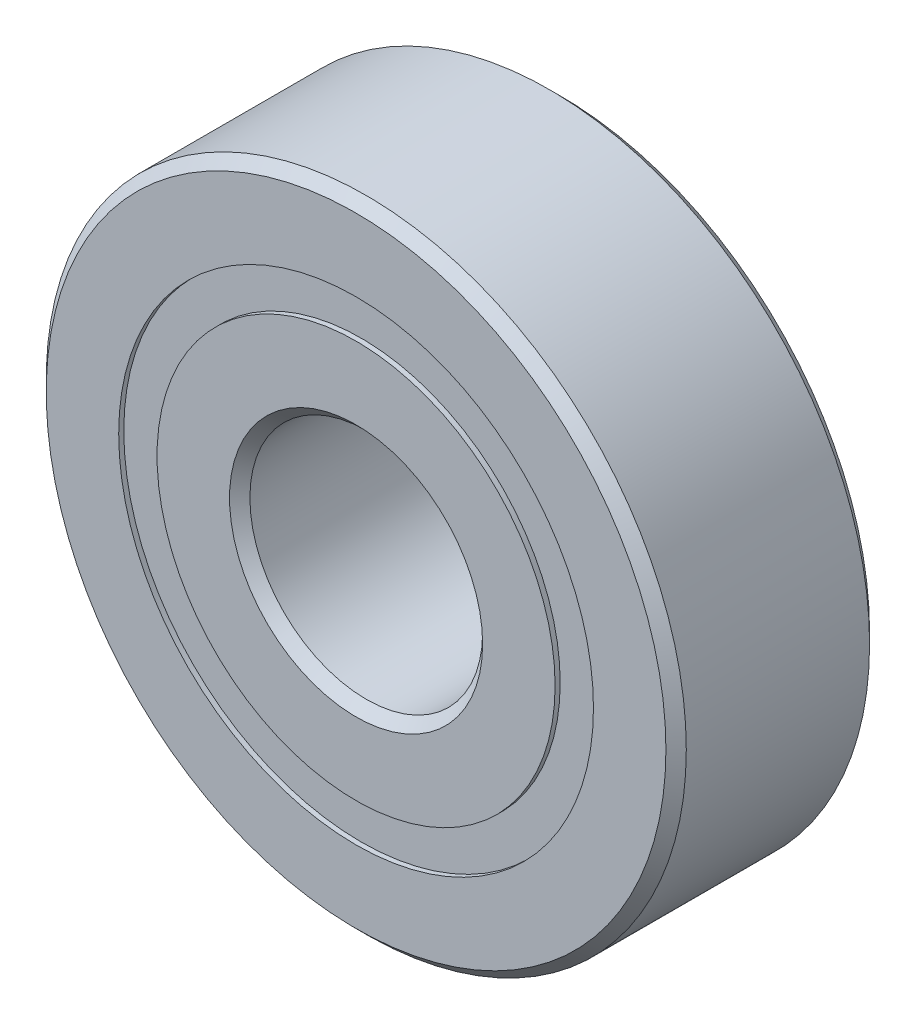
ISO-10303-21;
HEADER;
FILE_DESCRIPTION(('STEP AP214'),'2;1');
FILE_NAME('part.step','',(''),(''),'','','');
FILE_SCHEMA(('AUTOMOTIVE_DESIGN { 1 0 10303 214 1 1 1 1 }'));
ENDSEC;
DATA;
#1=APPLICATION_CONTEXT('core data for automotive mechanical design processes');
#2=APPLICATION_PROTOCOL_DEFINITION('international standard','automotive_design',2000,#1);
#3=PRODUCT_CONTEXT('',#1,'mechanical');
#4=PRODUCT('Part','Part','',(#3));
#5=PRODUCT_RELATED_PRODUCT_CATEGORY('part','',(#4));
#6=PRODUCT_DEFINITION_FORMATION('','',#4);
#7=PRODUCT_DEFINITION_CONTEXT('part definition',#1,'design');
#8=PRODUCT_DEFINITION('design','',#6,#7);
#9=PRODUCT_DEFINITION_SHAPE('','',#8);
#10=(LENGTH_UNIT() NAMED_UNIT(*) SI_UNIT(.MILLI.,.METRE.));
#11=(NAMED_UNIT(*) PLANE_ANGLE_UNIT() SI_UNIT($,.RADIAN.));
#12=(NAMED_UNIT(*) SI_UNIT($,.STERADIAN.) SOLID_ANGLE_UNIT());
#13=UNCERTAINTY_MEASURE_WITH_UNIT(LENGTH_MEASURE(1.E-05),#10,'distance_accuracy_value','');
#14=(GEOMETRIC_REPRESENTATION_CONTEXT(3) GLOBAL_UNCERTAINTY_ASSIGNED_CONTEXT((#13)) GLOBAL_UNIT_ASSIGNED_CONTEXT((#10,
#11,#12)) REPRESENTATION_CONTEXT('',''));
#15=CARTESIAN_POINT('',(0.,0.,0.));
#16=DIRECTION('',(0.,0.,1.));
#17=DIRECTION('',(1.,0.,0.));
#18=AXIS2_PLACEMENT_3D('',#15,#16,#17);
#19=CARTESIAN_POINT('',(0.,8.15934065934066,-3.325));
#20=DIRECTION('',(0.,0.,1.));
#21=DIRECTION('',(1.,0.,0.));
#22=AXIS2_PLACEMENT_3D('',#19,#20,#21);
#23=PLANE('',#22);
#24=CARTESIAN_POINT('',(0.,0.,-3.325));
#25=DIRECTION('',(0.,0.,1.));
#26=DIRECTION('',(1.,0.,0.));
#27=AXIS2_PLACEMENT_3D('',#24,#25,#26);
#28=CIRCLE('',#27,8.15934065934066);
#29=CARTESIAN_POINT('',(8.15934065934066,0.,-3.325));
#30=VERTEX_POINT('',#29);
#31=EDGE_CURVE('E57',#30,#30,#28,.T.);
#32=ORIENTED_EDGE('',*,*,#31,.F.);
#33=EDGE_LOOP('',(#32));
#34=FACE_BOUND('',#33,.T.);
#35=CARTESIAN_POINT('',(0.,0.,-3.325));
#36=DIRECTION('',(0.,0.,1.));
#37=DIRECTION('',(1.,0.,0.));
#38=AXIS2_PLACEMENT_3D('',#35,#36,#37);
#39=CIRCLE('',#38,6.84065934065934);
#40=CARTESIAN_POINT('',(6.84065934065934,0.,-3.325));
#41=VERTEX_POINT('',#40);
#42=EDGE_CURVE('E11',#41,#41,#39,.T.);
#43=ORIENTED_EDGE('',*,*,#42,.T.);
#44=EDGE_LOOP('',(#43));
#45=FACE_BOUND('',#44,.T.);
#46=ADVANCED_FACE('F43',(#34,#45),#23,.F.);
#47=CARTESIAN_POINT('',(0.,0.,3.5));
#48=DIRECTION('',(0.,0.,1.));
#49=DIRECTION('',(1.,0.,0.));
#50=AXIS2_PLACEMENT_3D('',#47,#48,#49);
#51=CYLINDRICAL_SURFACE('',#50,6.84065934065934);
#52=ORIENTED_EDGE('',*,*,#42,.F.);
#53=EDGE_LOOP('',(#52));
#54=FACE_BOUND('',#53,.T.);
#55=CARTESIAN_POINT('',(0.,0.,-1.68952158656808));
#56=DIRECTION('',(0.,0.,1.));
#57=DIRECTION('',(1.,0.,0.));
#58=AXIS2_PLACEMENT_3D('',#55,#56,#57);
#59=CIRCLE('',#58,6.84065934065934);
#60=CARTESIAN_POINT('',(6.84065934065934,0.,-1.68952158656808));
#61=VERTEX_POINT('',#60);
#62=EDGE_CURVE('E49',#61,#61,#59,.T.);
#63=ORIENTED_EDGE('',*,*,#62,.T.);
#64=EDGE_LOOP('',(#63));
#65=FACE_BOUND('',#64,.T.);
#66=ADVANCED_FACE('F66',(#54,#65),#51,.F.);
#67=CARTESIAN_POINT('',(0.,8.15934065934066,-1.68952158656808));
#68=DIRECTION('',(0.,0.,-1.));
#69=DIRECTION('',(-1.,0.,0.));
#70=AXIS2_PLACEMENT_3D('',#67,#68,#69);
#71=PLANE('',#70);
#72=ORIENTED_EDGE('',*,*,#62,.F.);
#73=EDGE_LOOP('',(#72));
#74=FACE_BOUND('',#73,.T.);
#75=CARTESIAN_POINT('',(0.,0.,-1.68952158656808));
#76=DIRECTION('',(0.,0.,1.));
#77=DIRECTION('',(1.,0.,0.));
#78=AXIS2_PLACEMENT_3D('',#75,#76,#77);
#79=CIRCLE('',#78,8.15934065934066);
#80=CARTESIAN_POINT('',(8.15934065934066,0.,-1.68952158656808));
#81=VERTEX_POINT('',#80);
#82=EDGE_CURVE('E53',#81,#81,#79,.T.);
#83=ORIENTED_EDGE('',*,*,#82,.T.);
#84=EDGE_LOOP('',(#83));
#85=FACE_BOUND('',#84,.T.);
#86=ADVANCED_FACE('F70',(#74,#85),#71,.F.);
#87=CARTESIAN_POINT('',(0.,0.,3.5));
#88=DIRECTION('',(0.,0.,1.));
#89=DIRECTION('',(1.,0.,0.));
#90=AXIS2_PLACEMENT_3D('',#87,#88,#89);
#91=CYLINDRICAL_SURFACE('',#90,8.15934065934066);
#92=ORIENTED_EDGE('',*,*,#82,.F.);
#93=EDGE_LOOP('',(#92));
#94=FACE_BOUND('',#93,.T.);
#95=ORIENTED_EDGE('',*,*,#31,.T.);
#96=EDGE_LOOP('',(#95));
#97=FACE_BOUND('',#96,.T.);
#98=ADVANCED_FACE('F63',(#94,#97),#91,.T.);
#99=CLOSED_SHELL('',(#46,#66,#86,#98));
#100=MANIFOLD_SOLID_BREP('B2',#99);
#101=CARTESIAN_POINT('',(0.,8.15934065934066,3.325));
#102=DIRECTION('',(0.,0.,-1.));
#103=DIRECTION('',(-1.,0.,0.));
#104=AXIS2_PLACEMENT_3D('',#101,#102,#103);
#105=PLANE('',#104);
#106=CARTESIAN_POINT('',(0.,0.,3.325));
#107=DIRECTION('',(0.,0.,1.));
#108=DIRECTION('',(1.,0.,0.));
#109=AXIS2_PLACEMENT_3D('',#106,#107,#108);
#110=CIRCLE('',#109,6.84065934065934);
#111=CARTESIAN_POINT('',(6.84065934065934,0.,3.325));
#112=VERTEX_POINT('',#111);
#113=EDGE_CURVE('E42',#112,#112,#110,.T.);
#114=ORIENTED_EDGE('',*,*,#113,.F.);
#115=EDGE_LOOP('',(#114));
#116=FACE_BOUND('',#115,.T.);
#117=CARTESIAN_POINT('',(0.,0.,3.325));
#118=DIRECTION('',(0.,0.,1.));
#119=DIRECTION('',(1.,0.,0.));
#120=AXIS2_PLACEMENT_3D('',#117,#118,#119);
#121=CIRCLE('',#120,8.15934065934066);
#122=CARTESIAN_POINT('',(8.15934065934066,0.,3.325));
#123=VERTEX_POINT('',#122);
#124=EDGE_CURVE('E124',#123,#123,#121,.T.);
#125=ORIENTED_EDGE('',*,*,#124,.T.);
#126=EDGE_LOOP('',(#125));
#127=FACE_BOUND('',#126,.T.);
#128=ADVANCED_FACE('F110',(#116,#127),#105,.F.);
#129=CARTESIAN_POINT('',(0.,0.,3.5));
#130=DIRECTION('',(0.,0.,1.));
#131=DIRECTION('',(1.,0.,0.));
#132=AXIS2_PLACEMENT_3D('',#129,#130,#131);
#133=CYLINDRICAL_SURFACE('',#132,6.84065934065934);
#134=CARTESIAN_POINT('',(0.,0.,1.68952158656808));
#135=DIRECTION('',(0.,0.,1.));
#136=DIRECTION('',(1.,0.,0.));
#137=AXIS2_PLACEMENT_3D('',#134,#135,#136);
#138=CIRCLE('',#137,6.84065934065934);
#139=CARTESIAN_POINT('',(6.84065934065934,0.,1.68952158656808));
#140=VERTEX_POINT('',#139);
#141=EDGE_CURVE('E116',#140,#140,#138,.T.);
#142=ORIENTED_EDGE('',*,*,#141,.F.);
#143=EDGE_LOOP('',(#142));
#144=FACE_BOUND('',#143,.T.);
#145=ORIENTED_EDGE('',*,*,#113,.T.);
#146=EDGE_LOOP('',(#145));
#147=FACE_BOUND('',#146,.T.);
#148=ADVANCED_FACE('F139',(#144,#147),#133,.F.);
#149=CARTESIAN_POINT('',(0.,8.15934065934066,1.68952158656808));
#150=DIRECTION('',(0.,0.,1.));
#151=DIRECTION('',(1.,0.,0.));
#152=AXIS2_PLACEMENT_3D('',#149,#150,#151);
#153=PLANE('',#152);
#154=CARTESIAN_POINT('',(0.,0.,1.68952158656808));
#155=DIRECTION('',(0.,0.,1.));
#156=DIRECTION('',(1.,0.,0.));
#157=AXIS2_PLACEMENT_3D('',#154,#155,#156);
#158=CIRCLE('',#157,8.15934065934066);
#159=CARTESIAN_POINT('',(8.15934065934066,0.,1.68952158656808));
#160=VERTEX_POINT('',#159);
#161=EDGE_CURVE('E120',#160,#160,#158,.T.);
#162=ORIENTED_EDGE('',*,*,#161,.F.);
#163=EDGE_LOOP('',(#162));
#164=FACE_BOUND('',#163,.T.);
#165=ORIENTED_EDGE('',*,*,#141,.T.);
#166=EDGE_LOOP('',(#165));
#167=FACE_BOUND('',#166,.T.);
#168=ADVANCED_FACE('F134',(#164,#167),#153,.F.);
#169=CARTESIAN_POINT('',(0.,0.,3.5));
#170=DIRECTION('',(0.,0.,1.));
#171=DIRECTION('',(1.,0.,0.));
#172=AXIS2_PLACEMENT_3D('',#169,#170,#171);
#173=CYLINDRICAL_SURFACE('',#172,8.15934065934066);
#174=ORIENTED_EDGE('',*,*,#124,.F.);
#175=EDGE_LOOP('',(#174));
#176=FACE_BOUND('',#175,.T.);
#177=ORIENTED_EDGE('',*,*,#161,.T.);
#178=EDGE_LOOP('',(#177));
#179=FACE_BOUND('',#178,.T.);
#180=ADVANCED_FACE('F131',(#176,#179),#173,.T.);
#181=CLOSED_SHELL('',(#128,#148,#168,#180));
#182=MANIFOLD_SOLID_BREP('B6',#181);
#183=CARTESIAN_POINT('',(-3.74999999999992,6.49519052838334,0.));
#184=DIRECTION('',(0.,0.,1.));
#185=DIRECTION('',(-0.499999999999989,0.866025403784445,0.));
#186=AXIS2_PLACEMENT_3D('',#183,#184,#185);
#187=SPHERICAL_SURFACE('',#186,1.68952158656808);
#188=CARTESIAN_POINT('',(-3.74999999999992,6.49519052838334,1.68952158656808));
#189=VERTEX_POINT('',#188);
#190=VERTEX_LOOP('',#189);
#191=FACE_BOUND('',#190,.T.);
#192=ADVANCED_FACE('F177',(#191),#187,.T.);
#193=CLOSED_SHELL('',(#192));
#194=MANIFOLD_SOLID_BREP('B37',#193);
#195=CARTESIAN_POINT('',(-6.49519052838325,3.75000000000008,0.));
#196=DIRECTION('',(0.,0.,1.));
#197=DIRECTION('',(-0.866025403784433,0.50000000000001,0.));
#198=AXIS2_PLACEMENT_3D('',#195,#196,#197);
#199=SPHERICAL_SURFACE('',#198,1.68952158656808);
#200=CARTESIAN_POINT('',(-6.49519052838325,3.75000000000008,1.68952158656808));
#201=VERTEX_POINT('',#200);
#202=VERTEX_LOOP('',#201);
#203=FACE_BOUND('',#202,.T.);
#204=ADVANCED_FACE('F197',(#203),#199,.T.);
#205=CLOSED_SHELL('',(#204));
#206=MANIFOLD_SOLID_BREP('B106',#205);
#207=CARTESIAN_POINT('',(-7.5,0.,0.));
#208=DIRECTION('',(0.,0.,1.));
#209=DIRECTION('',(-1.,0.,0.));
#210=AXIS2_PLACEMENT_3D('',#207,#208,#209);
#211=SPHERICAL_SURFACE('',#210,1.68952158656808);
#212=CARTESIAN_POINT('',(-7.5,0.,1.68952158656808));
#213=VERTEX_POINT('',#212);
#214=VERTEX_LOOP('',#213);
#215=FACE_BOUND('',#214,.T.);
#216=ADVANCED_FACE('F218',(#215),#211,.T.);
#217=CLOSED_SHELL('',(#216));
#218=MANIFOLD_SOLID_BREP('B173',#217);
#219=CARTESIAN_POINT('',(-6.49519052838332,-3.74999999999994,0.));
#220=DIRECTION('',(0.,0.,1.));
#221=DIRECTION('',(-0.866025403784443,-0.499999999999992,0.));
#222=AXIS2_PLACEMENT_3D('',#219,#220,#221);
#223=SPHERICAL_SURFACE('',#222,1.68952158656808);
#224=CARTESIAN_POINT('',(-6.49519052838332,-3.74999999999994,1.68952158656808));
#225=VERTEX_POINT('',#224);
#226=VERTEX_LOOP('',#225);
#227=FACE_BOUND('',#226,.T.);
#228=ADVANCED_FACE('F241',(#227),#223,.T.);
#229=CLOSED_SHELL('',(#228));
#230=MANIFOLD_SOLID_BREP('B193',#229);
#231=CARTESIAN_POINT('',(-3.75000000000005,-6.49519052838326,0.));
#232=DIRECTION('',(0.,0.,1.));
#233=DIRECTION('',(-0.500000000000007,-0.866025403784435,0.));
#234=AXIS2_PLACEMENT_3D('',#231,#232,#233);
#235=SPHERICAL_SURFACE('',#234,1.68952158656808);
#236=CARTESIAN_POINT('',(-3.75000000000005,-6.49519052838326,1.68952158656808));
#237=VERTEX_POINT('',#236);
#238=VERTEX_LOOP('',#237);
#239=FACE_BOUND('',#238,.T.);
#240=ADVANCED_FACE('F261',(#239),#235,.T.);
#241=CLOSED_SHELL('',(#240));
#242=MANIFOLD_SOLID_BREP('B214',#241);
#243=CARTESIAN_POINT('',(0.,-7.5,0.));
#244=DIRECTION('',(0.,0.,1.));
#245=DIRECTION('',(0.,-1.,0.));
#246=AXIS2_PLACEMENT_3D('',#243,#244,#245);
#247=SPHERICAL_SURFACE('',#246,1.68952158656808);
#248=CARTESIAN_POINT('',(0.,-7.5,1.68952158656808));
#249=VERTEX_POINT('',#248);
#250=VERTEX_LOOP('',#249);
#251=FACE_BOUND('',#250,.T.);
#252=ADVANCED_FACE('F281',(#251),#247,.T.);
#253=CLOSED_SHELL('',(#252));
#254=MANIFOLD_SOLID_BREP('B237',#253);
#255=CARTESIAN_POINT('',(3.74999999999996,-6.49519052838331,0.));
#256=DIRECTION('',(0.,0.,1.));
#257=DIRECTION('',(0.499999999999995,-0.866025403784442,0.));
#258=AXIS2_PLACEMENT_3D('',#255,#256,#257);
#259=SPHERICAL_SURFACE('',#258,1.68952158656808);
#260=CARTESIAN_POINT('',(3.74999999999996,-6.49519052838331,1.68952158656808));
#261=VERTEX_POINT('',#260);
#262=VERTEX_LOOP('',#261);
#263=FACE_BOUND('',#262,.T.);
#264=ADVANCED_FACE('F302',(#263),#259,.T.);
#265=CLOSED_SHELL('',(#264));
#266=MANIFOLD_SOLID_BREP('B257',#265);
#267=CARTESIAN_POINT('',(6.49519052838327,-3.75000000000003,0.));
#268=DIRECTION('',(0.,0.,1.));
#269=DIRECTION('',(0.866025403784436,-0.500000000000004,0.));
#270=AXIS2_PLACEMENT_3D('',#267,#268,#269);
#271=SPHERICAL_SURFACE('',#270,1.68952158656808);
#272=CARTESIAN_POINT('',(6.49519052838327,-3.75000000000003,1.68952158656808));
#273=VERTEX_POINT('',#272);
#274=VERTEX_LOOP('',#273);
#275=FACE_BOUND('',#274,.T.);
#276=ADVANCED_FACE('F325',(#275),#271,.T.);
#277=CLOSED_SHELL('',(#276));
#278=MANIFOLD_SOLID_BREP('B277',#277);
#279=CARTESIAN_POINT('',(7.5,0.,0.));
#280=DIRECTION('',(0.,0.,1.));
#281=DIRECTION('',(1.,0.,0.));
#282=AXIS2_PLACEMENT_3D('',#279,#280,#281);
#283=SPHERICAL_SURFACE('',#282,1.68952158656808);
#284=CARTESIAN_POINT('',(7.5,0.,1.68952158656808));
#285=VERTEX_POINT('',#284);
#286=VERTEX_LOOP('',#285);
#287=FACE_BOUND('',#286,.T.);
#288=ADVANCED_FACE('F345',(#287),#283,.T.);
#289=CLOSED_SHELL('',(#288));
#290=MANIFOLD_SOLID_BREP('B298',#289);
#291=CARTESIAN_POINT('',(6.4951905283833,3.74999999999998,0.));
#292=DIRECTION('',(0.,0.,1.));
#293=DIRECTION('',(0.86602540378444,0.499999999999998,0.));
#294=AXIS2_PLACEMENT_3D('',#291,#292,#293);
#295=SPHERICAL_SURFACE('',#294,1.68952158656808);
#296=CARTESIAN_POINT('',(6.4951905283833,3.74999999999998,1.68952158656808));
#297=VERTEX_POINT('',#296);
#298=VERTEX_LOOP('',#297);
#299=FACE_BOUND('',#298,.T.);
#300=ADVANCED_FACE('F365',(#299),#295,.T.);
#301=CLOSED_SHELL('',(#300));
#302=MANIFOLD_SOLID_BREP('B321',#301);
#303=CARTESIAN_POINT('',(3.75000000000001,6.49519052838328,0.));
#304=DIRECTION('',(0.,0.,1.));
#305=DIRECTION('',(0.500000000000001,0.866025403784438,0.));
#306=AXIS2_PLACEMENT_3D('',#303,#304,#305);
#307=SPHERICAL_SURFACE('',#306,1.68952158656808);
#308=CARTESIAN_POINT('',(3.75000000000001,6.49519052838328,1.68952158656808));
#309=VERTEX_POINT('',#308);
#310=VERTEX_LOOP('',#309);
#311=FACE_BOUND('',#310,.T.);
#312=ADVANCED_FACE('F385',(#311),#307,.T.);
#313=CLOSED_SHELL('',(#312));
#314=MANIFOLD_SOLID_BREP('B341',#313);
#315=CARTESIAN_POINT('',(0.,7.5,0.));
#316=DIRECTION('',(0.,0.,1.));
#317=DIRECTION('',(0.,1.,0.));
#318=AXIS2_PLACEMENT_3D('',#315,#316,#317);
#319=SPHERICAL_SURFACE('',#318,1.68952158656808);
#320=CARTESIAN_POINT('',(0.,7.5,1.68952158656808));
#321=VERTEX_POINT('',#320);
#322=VERTEX_LOOP('',#321);
#323=FACE_BOUND('',#322,.T.);
#324=ADVANCED_FACE('F409',(#323),#319,.T.);
#325=CLOSED_SHELL('',(#324));
#326=MANIFOLD_SOLID_BREP('B361',#325);
#327=CARTESIAN_POINT('',(0.,6.84065934065934,3.5));
#328=DIRECTION('',(0.,0.,-1.));
#329=DIRECTION('',(-1.,0.,0.));
#330=AXIS2_PLACEMENT_3D('',#327,#328,#329);
#331=PLANE('',#330);
#332=CARTESIAN_POINT('',(0.,0.,3.5));
#333=DIRECTION('',(0.,0.,1.));
#334=DIRECTION('',(1.,0.,0.));
#335=AXIS2_PLACEMENT_3D('',#332,#333,#334);
#336=CIRCLE('',#335,4.35);
#337=CARTESIAN_POINT('',(4.35,0.,3.5));
#338=VERTEX_POINT('',#337);
#339=EDGE_CURVE('E464',#338,#338,#336,.T.);
#340=ORIENTED_EDGE('',*,*,#339,.F.);
#341=EDGE_LOOP('',(#340));
#342=FACE_BOUND('',#341,.T.);
#343=CARTESIAN_POINT('',(0.,0.,3.5));
#344=DIRECTION('',(0.,0.,1.));
#345=DIRECTION('',(1.,0.,0.));
#346=AXIS2_PLACEMENT_3D('',#343,#344,#345);
#347=CIRCLE('',#346,6.84065934065934);
#348=CARTESIAN_POINT('',(6.84065934065934,0.,3.5));
#349=VERTEX_POINT('',#348);
#350=EDGE_CURVE('E408',#349,#349,#347,.T.);
#351=ORIENTED_EDGE('',*,*,#350,.T.);
#352=EDGE_LOOP('',(#351));
#353=FACE_BOUND('',#352,.T.);
#354=ADVANCED_FACE('F436',(#342,#353),#331,.F.);
#355=CARTESIAN_POINT('',(0.,0.,3.5));
#356=DIRECTION('',(0.,0.,1.));
#357=DIRECTION('',(1.,0.,0.));
#358=AXIS2_PLACEMENT_3D('',#355,#356,#357);
#359=CYLINDRICAL_SURFACE('',#358,6.84065934065934);
#360=ORIENTED_EDGE('',*,*,#350,.F.);
#361=EDGE_LOOP('',(#360));
#362=FACE_BOUND('',#361,.T.);
#363=CARTESIAN_POINT('',(0.,0.,1.55555555555556));
#364=DIRECTION('',(0.,0.,1.));
#365=DIRECTION('',(1.,0.,0.));
#366=AXIS2_PLACEMENT_3D('',#363,#364,#365);
#367=CIRCLE('',#366,6.84065934065934);
#368=CARTESIAN_POINT('',(6.84065934065934,0.,1.55555555555556));
#369=VERTEX_POINT('',#368);
#370=EDGE_CURVE('E442',#369,#369,#367,.T.);
#371=ORIENTED_EDGE('',*,*,#370,.T.);
#372=EDGE_LOOP('',(#371));
#373=FACE_BOUND('',#372,.T.);
#374=ADVANCED_FACE('F471',(#362,#373),#359,.T.);
#375=CARTESIAN_POINT('',(0.,0.,0.));
#376=DIRECTION('',(0.,0.,1.));
#377=DIRECTION('',(1.,0.,0.));
#378=AXIS2_PLACEMENT_3D('',#375,#376,#377);
#379=TOROIDAL_SURFACE('',#378,7.5,1.68952158656808);
#380=ORIENTED_EDGE('',*,*,#370,.F.);
#381=EDGE_LOOP('',(#380));
#382=FACE_BOUND('',#381,.T.);
#383=CARTESIAN_POINT('',(0.,0.,-1.55555555555556));
#384=DIRECTION('',(0.,0.,1.));
#385=DIRECTION('',(1.,0.,0.));
#386=AXIS2_PLACEMENT_3D('',#383,#384,#385);
#387=CIRCLE('',#386,6.84065934065934);
#388=CARTESIAN_POINT('',(6.84065934065934,0.,-1.55555555555556));
#389=VERTEX_POINT('',#388);
#390=EDGE_CURVE('E446',#389,#389,#387,.T.);
#391=ORIENTED_EDGE('',*,*,#390,.T.);
#392=EDGE_LOOP('',(#391));
#393=FACE_BOUND('',#392,.T.);
#394=ADVANCED_FACE('F475',(#382,#393),#379,.F.);
#395=CARTESIAN_POINT('',(0.,0.,3.5));
#396=DIRECTION('',(0.,0.,1.));
#397=DIRECTION('',(1.,0.,0.));
#398=AXIS2_PLACEMENT_3D('',#395,#396,#397);
#399=CYLINDRICAL_SURFACE('',#398,6.84065934065934);
#400=ORIENTED_EDGE('',*,*,#390,.F.);
#401=EDGE_LOOP('',(#400));
#402=FACE_BOUND('',#401,.T.);
#403=CARTESIAN_POINT('',(0.,0.,-3.5));
#404=DIRECTION('',(0.,0.,1.));
#405=DIRECTION('',(1.,0.,0.));
#406=AXIS2_PLACEMENT_3D('',#403,#404,#405);
#407=CIRCLE('',#406,6.84065934065934);
#408=CARTESIAN_POINT('',(6.84065934065934,0.,-3.5));
#409=VERTEX_POINT('',#408);
#410=EDGE_CURVE('E450',#409,#409,#407,.T.);
#411=ORIENTED_EDGE('',*,*,#410,.T.);
#412=EDGE_LOOP('',(#411));
#413=FACE_BOUND('',#412,.T.);
#414=ADVANCED_FACE('F480',(#402,#413),#399,.T.);
#415=CARTESIAN_POINT('',(0.,4.35,-3.5));
#416=DIRECTION('',(0.,0.,1.));
#417=DIRECTION('',(1.,0.,0.));
#418=AXIS2_PLACEMENT_3D('',#415,#416,#417);
#419=PLANE('',#418);
#420=ORIENTED_EDGE('',*,*,#410,.F.);
#421=EDGE_LOOP('',(#420));
#422=FACE_BOUND('',#421,.T.);
#423=CARTESIAN_POINT('',(0.,0.,-3.5));
#424=DIRECTION('',(0.,0.,1.));
#425=DIRECTION('',(1.,0.,0.));
#426=AXIS2_PLACEMENT_3D('',#423,#424,#425);
#427=CIRCLE('',#426,4.35);
#428=CARTESIAN_POINT('',(4.35,0.,-3.5));
#429=VERTEX_POINT('',#428);
#430=EDGE_CURVE('E455',#429,#429,#427,.T.);
#431=ORIENTED_EDGE('',*,*,#430,.T.);
#432=EDGE_LOOP('',(#431));
#433=FACE_BOUND('',#432,.T.);
#434=ADVANCED_FACE('F486',(#422,#433),#419,.F.);
#435=CARTESIAN_POINT('',(0.,0.,-3.15));
#436=DIRECTION('',(0.,0.,-1.));
#437=DIRECTION('',(-1.,0.,0.));
#438=AXIS2_PLACEMENT_3D('',#435,#436,#437);
#439=CONICAL_SURFACE('',#438,4.,0.78539816339745);
#440=ORIENTED_EDGE('',*,*,#430,.F.);
#441=EDGE_LOOP('',(#440));
#442=FACE_BOUND('',#441,.T.);
#443=CARTESIAN_POINT('',(0.,0.,-3.15));
#444=DIRECTION('',(0.,0.,1.));
#445=DIRECTION('',(1.,0.,0.));
#446=AXIS2_PLACEMENT_3D('',#443,#444,#445);
#447=CIRCLE('',#446,4.);
#448=CARTESIAN_POINT('',(4.,0.,-3.15));
#449=VERTEX_POINT('',#448);
#450=EDGE_CURVE('E458',#449,#449,#447,.T.);
#451=ORIENTED_EDGE('',*,*,#450,.T.);
#452=EDGE_LOOP('',(#451));
#453=FACE_BOUND('',#452,.T.);
#454=ADVANCED_FACE('F490',(#442,#453),#439,.F.);
#455=CARTESIAN_POINT('',(0.,0.,3.5));
#456=DIRECTION('',(0.,0.,1.));
#457=DIRECTION('',(1.,0.,0.));
#458=AXIS2_PLACEMENT_3D('',#455,#456,#457);
#459=CYLINDRICAL_SURFACE('',#458,4.);
#460=ORIENTED_EDGE('',*,*,#450,.F.);
#461=EDGE_LOOP('',(#460));
#462=FACE_BOUND('',#461,.T.);
#463=CARTESIAN_POINT('',(0.,0.,3.15));
#464=DIRECTION('',(0.,0.,1.));
#465=DIRECTION('',(1.,0.,0.));
#466=AXIS2_PLACEMENT_3D('',#463,#464,#465);
#467=CIRCLE('',#466,4.);
#468=CARTESIAN_POINT('',(4.,0.,3.15));
#469=VERTEX_POINT('',#468);
#470=EDGE_CURVE('E461',#469,#469,#467,.T.);
#471=ORIENTED_EDGE('',*,*,#470,.T.);
#472=EDGE_LOOP('',(#471));
#473=FACE_BOUND('',#472,.T.);
#474=ADVANCED_FACE('F494',(#462,#473),#459,.F.);
#475=CARTESIAN_POINT('',(0.,0.,3.5));
#476=DIRECTION('',(0.,0.,1.));
#477=DIRECTION('',(1.,0.,0.));
#478=AXIS2_PLACEMENT_3D('',#475,#476,#477);
#479=CONICAL_SURFACE('',#478,4.35,0.78539816339745);
#480=ORIENTED_EDGE('',*,*,#470,.F.);
#481=EDGE_LOOP('',(#480));
#482=FACE_BOUND('',#481,.T.);
#483=ORIENTED_EDGE('',*,*,#339,.T.);
#484=EDGE_LOOP('',(#483));
#485=FACE_BOUND('',#484,.T.);
#486=ADVANCED_FACE('F468',(#482,#485),#479,.F.);
#487=CLOSED_SHELL('',(#354,#374,#394,#414,#434,#454,#474,#486));
#488=MANIFOLD_SOLID_BREP('B381',#487);
#489=CARTESIAN_POINT('',(0.,0.,3.15));
#490=DIRECTION('',(0.,0.,-1.));
#491=DIRECTION('',(-1.,0.,0.));
#492=AXIS2_PLACEMENT_3D('',#489,#490,#491);
#493=CONICAL_SURFACE('',#492,11.,0.785398163397448);
#494=CARTESIAN_POINT('',(0.,0.,3.5));
#495=DIRECTION('',(0.,0.,1.));
#496=DIRECTION('',(1.,0.,0.));
#497=AXIS2_PLACEMENT_3D('',#494,#495,#496);
#498=CIRCLE('',#497,10.65);
#499=CARTESIAN_POINT('',(10.65,0.,3.5));
#500=VERTEX_POINT('',#499);
#501=EDGE_CURVE('E591',#500,#500,#498,.T.);
#502=ORIENTED_EDGE('',*,*,#501,.F.);
#503=EDGE_LOOP('',(#502));
#504=FACE_BOUND('',#503,.T.);
#505=CARTESIAN_POINT('',(0.,0.,3.15));
#506=DIRECTION('',(0.,0.,1.));
#507=DIRECTION('',(1.,0.,0.));
#508=AXIS2_PLACEMENT_3D('',#505,#506,#507);
#509=CIRCLE('',#508,11.);
#510=CARTESIAN_POINT('',(11.,0.,3.15));
#511=VERTEX_POINT('',#510);
#512=EDGE_CURVE('E435',#511,#511,#509,.T.);
#513=ORIENTED_EDGE('',*,*,#512,.T.);
#514=EDGE_LOOP('',(#513));
#515=FACE_BOUND('',#514,.T.);
#516=ADVANCED_FACE('F563',(#504,#515),#493,.T.);
#517=CARTESIAN_POINT('',(0.,0.,3.5));
#518=DIRECTION('',(0.,0.,1.));
#519=DIRECTION('',(1.,0.,0.));
#520=AXIS2_PLACEMENT_3D('',#517,#518,#519);
#521=CYLINDRICAL_SURFACE('',#520,11.);
#522=ORIENTED_EDGE('',*,*,#512,.F.);
#523=EDGE_LOOP('',(#522));
#524=FACE_BOUND('',#523,.T.);
#525=CARTESIAN_POINT('',(0.,0.,-3.15));
#526=DIRECTION('',(0.,0.,1.));
#527=DIRECTION('',(1.,0.,0.));
#528=AXIS2_PLACEMENT_3D('',#525,#526,#527);
#529=CIRCLE('',#528,11.);
#530=CARTESIAN_POINT('',(11.,0.,-3.15));
#531=VERTEX_POINT('',#530);
#532=EDGE_CURVE('E569',#531,#531,#529,.T.);
#533=ORIENTED_EDGE('',*,*,#532,.T.);
#534=EDGE_LOOP('',(#533));
#535=FACE_BOUND('',#534,.T.);
#536=ADVANCED_FACE('F598',(#524,#535),#521,.T.);
#537=CARTESIAN_POINT('',(0.,0.,-3.5));
#538=DIRECTION('',(0.,0.,1.));
#539=DIRECTION('',(1.,0.,0.));
#540=AXIS2_PLACEMENT_3D('',#537,#538,#539);
#541=CONICAL_SURFACE('',#540,10.65,0.785398163397448);
#542=ORIENTED_EDGE('',*,*,#532,.F.);
#543=EDGE_LOOP('',(#542));
#544=FACE_BOUND('',#543,.T.);
#545=CARTESIAN_POINT('',(0.,0.,-3.5));
#546=DIRECTION('',(0.,0.,1.));
#547=DIRECTION('',(1.,0.,0.));
#548=AXIS2_PLACEMENT_3D('',#545,#546,#547);
#549=CIRCLE('',#548,10.65);
#550=CARTESIAN_POINT('',(10.65,0.,-3.5));
#551=VERTEX_POINT('',#550);
#552=EDGE_CURVE('E573',#551,#551,#549,.T.);
#553=ORIENTED_EDGE('',*,*,#552,.T.);
#554=EDGE_LOOP('',(#553));
#555=FACE_BOUND('',#554,.T.);
#556=ADVANCED_FACE('F602',(#544,#555),#541,.T.);
#557=CARTESIAN_POINT('',(0.,10.65,-3.5));
#558=DIRECTION('',(0.,0.,1.));
#559=DIRECTION('',(1.,0.,0.));
#560=AXIS2_PLACEMENT_3D('',#557,#558,#559);
#561=PLANE('',#560);
#562=ORIENTED_EDGE('',*,*,#552,.F.);
#563=EDGE_LOOP('',(#562));
#564=FACE_BOUND('',#563,.T.);
#565=CARTESIAN_POINT('',(0.,0.,-3.5));
#566=DIRECTION('',(0.,0.,1.));
#567=DIRECTION('',(1.,0.,0.));
#568=AXIS2_PLACEMENT_3D('',#565,#566,#567);
#569=CIRCLE('',#568,8.15934065934066);
#570=CARTESIAN_POINT('',(8.15934065934066,0.,-3.5));
#571=VERTEX_POINT('',#570);
#572=EDGE_CURVE('E577',#571,#571,#569,.T.);
#573=ORIENTED_EDGE('',*,*,#572,.T.);
#574=EDGE_LOOP('',(#573));
#575=FACE_BOUND('',#574,.T.);
#576=ADVANCED_FACE('F607',(#564,#575),#561,.F.);
#577=CARTESIAN_POINT('',(0.,0.,3.5));
#578=DIRECTION('',(0.,0.,1.));
#579=DIRECTION('',(1.,0.,0.));
#580=AXIS2_PLACEMENT_3D('',#577,#578,#579);
#581=CYLINDRICAL_SURFACE('',#580,8.15934065934066);
#582=ORIENTED_EDGE('',*,*,#572,.F.);
#583=EDGE_LOOP('',(#582));
#584=FACE_BOUND('',#583,.T.);
#585=CARTESIAN_POINT('',(0.,0.,-1.55555555555556));
#586=DIRECTION('',(0.,0.,1.));
#587=DIRECTION('',(1.,0.,0.));
#588=AXIS2_PLACEMENT_3D('',#585,#586,#587);
#589=CIRCLE('',#588,8.15934065934066);
#590=CARTESIAN_POINT('',(8.15934065934066,0.,-1.55555555555556));
#591=VERTEX_POINT('',#590);
#592=EDGE_CURVE('E582',#591,#591,#589,.T.);
#593=ORIENTED_EDGE('',*,*,#592,.T.);
#594=EDGE_LOOP('',(#593));
#595=FACE_BOUND('',#594,.T.);
#596=ADVANCED_FACE('F613',(#584,#595),#581,.F.);
#597=CARTESIAN_POINT('',(0.,0.,0.));
#598=DIRECTION('',(0.,0.,1.));
#599=DIRECTION('',(1.,0.,0.));
#600=AXIS2_PLACEMENT_3D('',#597,#598,#599);
#601=TOROIDAL_SURFACE('',#600,7.5,1.68952158656808);
#602=ORIENTED_EDGE('',*,*,#592,.F.);
#603=EDGE_LOOP('',(#602));
#604=FACE_BOUND('',#603,.T.);
#605=CARTESIAN_POINT('',(0.,0.,1.55555555555556));
#606=DIRECTION('',(0.,0.,1.));
#607=DIRECTION('',(1.,0.,0.));
#608=AXIS2_PLACEMENT_3D('',#605,#606,#607);
#609=CIRCLE('',#608,8.15934065934066);
#610=CARTESIAN_POINT('',(8.15934065934066,0.,1.55555555555556));
#611=VERTEX_POINT('',#610);
#612=EDGE_CURVE('E585',#611,#611,#609,.T.);
#613=ORIENTED_EDGE('',*,*,#612,.T.);
#614=EDGE_LOOP('',(#613));
#615=FACE_BOUND('',#614,.T.);
#616=ADVANCED_FACE('F617',(#604,#615),#601,.F.);
#617=CARTESIAN_POINT('',(0.,0.,3.5));
#618=DIRECTION('',(0.,0.,1.));
#619=DIRECTION('',(1.,0.,0.));
#620=AXIS2_PLACEMENT_3D('',#617,#618,#619);
#621=CYLINDRICAL_SURFACE('',#620,8.15934065934066);
#622=ORIENTED_EDGE('',*,*,#612,.F.);
#623=EDGE_LOOP('',(#622));
#624=FACE_BOUND('',#623,.T.);
#625=CARTESIAN_POINT('',(0.,0.,3.5));
#626=DIRECTION('',(0.,0.,1.));
#627=DIRECTION('',(1.,0.,0.));
#628=AXIS2_PLACEMENT_3D('',#625,#626,#627);
#629=CIRCLE('',#628,8.15934065934066);
#630=CARTESIAN_POINT('',(8.15934065934066,0.,3.5));
#631=VERTEX_POINT('',#630);
#632=EDGE_CURVE('E588',#631,#631,#629,.T.);
#633=ORIENTED_EDGE('',*,*,#632,.T.);
#634=EDGE_LOOP('',(#633));
#635=FACE_BOUND('',#634,.T.);
#636=ADVANCED_FACE('F621',(#624,#635),#621,.F.);
#637=CARTESIAN_POINT('',(0.,10.65,3.5));
#638=DIRECTION('',(0.,0.,-1.));
#639=DIRECTION('',(-1.,0.,0.));
#640=AXIS2_PLACEMENT_3D('',#637,#638,#639);
#641=PLANE('',#640);
#642=ORIENTED_EDGE('',*,*,#632,.F.);
#643=EDGE_LOOP('',(#642));
#644=FACE_BOUND('',#643,.T.);
#645=ORIENTED_EDGE('',*,*,#501,.T.);
#646=EDGE_LOOP('',(#645));
#647=FACE_BOUND('',#646,.T.);
#648=ADVANCED_FACE('F595',(#644,#647),#641,.F.);
#649=CLOSED_SHELL('',(#516,#536,#556,#576,#596,#616,#636,#648));
#650=MANIFOLD_SOLID_BREP('B403',#649);
#651=ADVANCED_BREP_SHAPE_REPRESENTATION('',(#18,#100,#182,#194,#206,#218,#230,#242,#254,#266,
#278,#290,#302,#314,#326,#488,#650),#14);
#652=SHAPE_DEFINITION_REPRESENTATION(#9,#651);
ENDSEC;
END-ISO-10303-21;
